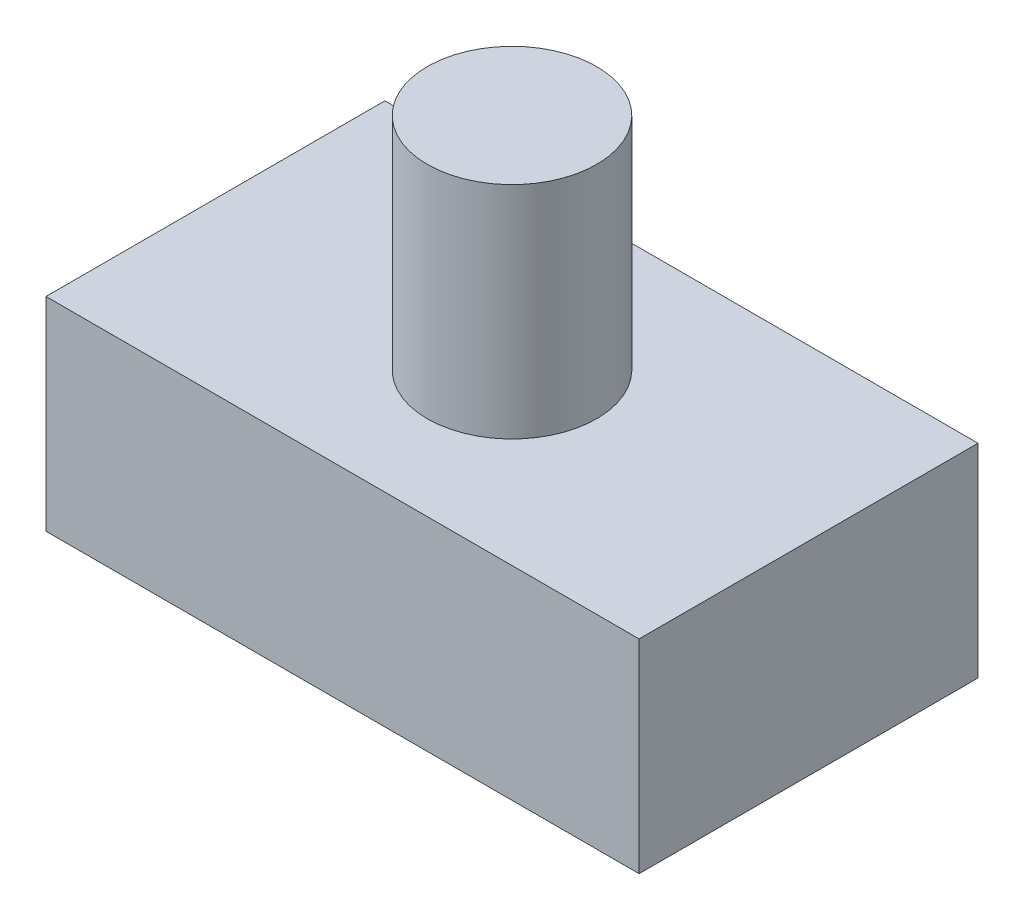
ISO-10303-21;
HEADER;
FILE_DESCRIPTION(('STEP AP214'),'2;1');
FILE_NAME('part.step','',(''),(''),'','','');
FILE_SCHEMA(('AUTOMOTIVE_DESIGN { 1 0 10303 214 1 1 1 1 }'));
ENDSEC;
DATA;
#1=APPLICATION_CONTEXT('core data for automotive mechanical design processes');
#2=APPLICATION_PROTOCOL_DEFINITION('international standard','automotive_design',2000,#1);
#3=PRODUCT_CONTEXT('',#1,'mechanical');
#4=PRODUCT('Part','Part','',(#3));
#5=PRODUCT_RELATED_PRODUCT_CATEGORY('part','',(#4));
#6=PRODUCT_DEFINITION_FORMATION('','',#4);
#7=PRODUCT_DEFINITION_CONTEXT('part definition',#1,'design');
#8=PRODUCT_DEFINITION('design','',#6,#7);
#9=PRODUCT_DEFINITION_SHAPE('','',#8);
#10=(LENGTH_UNIT() NAMED_UNIT(*) SI_UNIT(.MILLI.,.METRE.));
#11=(NAMED_UNIT(*) PLANE_ANGLE_UNIT() SI_UNIT($,.RADIAN.));
#12=(NAMED_UNIT(*) SI_UNIT($,.STERADIAN.) SOLID_ANGLE_UNIT());
#13=UNCERTAINTY_MEASURE_WITH_UNIT(LENGTH_MEASURE(1.E-05),#10,'distance_accuracy_value','');
#14=(GEOMETRIC_REPRESENTATION_CONTEXT(3) GLOBAL_UNCERTAINTY_ASSIGNED_CONTEXT((#13)) GLOBAL_UNIT_ASSIGNED_CONTEXT((#10,
#11,#12)) REPRESENTATION_CONTEXT('',''));
#15=CARTESIAN_POINT('',(0.,0.,0.));
#16=DIRECTION('',(0.,0.,1.));
#17=DIRECTION('',(1.,0.,0.));
#18=AXIS2_PLACEMENT_3D('',#15,#16,#17);
#19=CARTESIAN_POINT('',(0.,12.,0.));
#20=DIRECTION('',(0.,1.,0.));
#21=DIRECTION('',(0.,0.,1.));
#22=AXIS2_PLACEMENT_3D('',#19,#20,#21);
#23=PLANE('',#22);
#24=DIRECTION('',(0.,0.,-1.));
#25=VECTOR('',#24,1.);
#26=CARTESIAN_POINT('',(-17.5,12.,0.));
#27=LINE('',#26,#25);
#28=CARTESIAN_POINT('',(-17.5,12.,10.));
#29=VERTEX_POINT('',#28);
#30=CARTESIAN_POINT('',(-17.5,12.,-10.));
#31=VERTEX_POINT('',#30);
#32=EDGE_CURVE('E92',#29,#31,#27,.T.);
#33=ORIENTED_EDGE('',*,*,#32,.F.);
#34=DIRECTION('',(-1.,0.,0.));
#35=VECTOR('',#34,1.);
#36=CARTESIAN_POINT('',(0.,12.,10.));
#37=LINE('',#36,#35);
#38=CARTESIAN_POINT('',(17.5,12.,9.99999999999999));
#39=VERTEX_POINT('',#38);
#40=EDGE_CURVE('E84',#39,#29,#37,.T.);
#41=ORIENTED_EDGE('',*,*,#40,.F.);
#42=DIRECTION('',(0.,0.,-1.));
#43=VECTOR('',#42,1.);
#44=CARTESIAN_POINT('',(17.5,12.,0.));
#45=LINE('',#44,#43);
#46=CARTESIAN_POINT('',(17.5,12.,-10.));
#47=VERTEX_POINT('',#46);
#48=EDGE_CURVE('E88',#39,#47,#45,.T.);
#49=ORIENTED_EDGE('',*,*,#48,.T.);
#50=DIRECTION('',(-1.,0.,0.));
#51=VECTOR('',#50,1.);
#52=CARTESIAN_POINT('',(0.,12.,-10.));
#53=LINE('',#52,#51);
#54=EDGE_CURVE('E51',#47,#31,#53,.T.);
#55=ORIENTED_EDGE('',*,*,#54,.T.);
#56=EDGE_LOOP('',(#33,#41,#49,#55));
#57=FACE_BOUND('',#56,.T.);
#58=CARTESIAN_POINT('',(0.,12.,0.));
#59=DIRECTION('',(0.,1.,0.));
#60=DIRECTION('',(0.,0.,1.));
#61=AXIS2_PLACEMENT_3D('',#58,#59,#60);
#62=CIRCLE('',#61,5.);
#63=CARTESIAN_POINT('',(0.,12.,5.));
#64=VERTEX_POINT('',#63);
#65=EDGE_CURVE('E102',#64,#64,#62,.F.);
#66=ORIENTED_EDGE('',*,*,#65,.T.);
#67=EDGE_LOOP('',(#66));
#68=FACE_BOUND('',#67,.T.);
#69=ADVANCED_FACE('F34',(#57,#68),#23,.T.);
#70=CARTESIAN_POINT('',(-17.5,12.,0.));
#71=DIRECTION('',(-1.,0.,0.));
#72=DIRECTION('',(0.,0.,1.));
#73=AXIS2_PLACEMENT_3D('',#70,#71,#72);
#74=PLANE('',#73);
#75=DIRECTION('',(0.,0.,-1.));
#76=VECTOR('',#75,1.);
#77=CARTESIAN_POINT('',(-17.5,0.,0.));
#78=LINE('',#77,#76);
#79=CARTESIAN_POINT('',(-17.5,0.,10.));
#80=VERTEX_POINT('',#79);
#81=CARTESIAN_POINT('',(-17.5,0.,-10.));
#82=VERTEX_POINT('',#81);
#83=EDGE_CURVE('E99',#80,#82,#78,.T.);
#84=ORIENTED_EDGE('',*,*,#83,.F.);
#85=DIRECTION('',(0.,-1.,0.));
#86=VECTOR('',#85,1.);
#87=CARTESIAN_POINT('',(-17.5,12.,10.));
#88=LINE('',#87,#86);
#89=EDGE_CURVE('E11',#29,#80,#88,.T.);
#90=ORIENTED_EDGE('',*,*,#89,.F.);
#91=ORIENTED_EDGE('',*,*,#32,.T.);
#92=DIRECTION('',(0.,-1.,0.));
#93=VECTOR('',#92,1.);
#94=CARTESIAN_POINT('',(-17.5,12.,-10.));
#95=LINE('',#94,#93);
#96=EDGE_CURVE('E73',#31,#82,#95,.T.);
#97=ORIENTED_EDGE('',*,*,#96,.T.);
#98=EDGE_LOOP('',(#84,#90,#91,#97));
#99=FACE_BOUND('',#98,.T.);
#100=ADVANCED_FACE('F36',(#99),#74,.T.);
#101=CARTESIAN_POINT('',(0.,12.,10.));
#102=DIRECTION('',(0.,0.,1.));
#103=DIRECTION('',(1.,0.,0.));
#104=AXIS2_PLACEMENT_3D('',#101,#102,#103);
#105=PLANE('',#104);
#106=DIRECTION('',(-1.,0.,0.));
#107=VECTOR('',#106,1.);
#108=CARTESIAN_POINT('',(0.,0.,10.));
#109=LINE('',#108,#107);
#110=CARTESIAN_POINT('',(17.5,0.,9.99999999999999));
#111=VERTEX_POINT('',#110);
#112=EDGE_CURVE('E86',#111,#80,#109,.T.);
#113=ORIENTED_EDGE('',*,*,#112,.F.);
#114=DIRECTION('',(0.,-1.,0.));
#115=VECTOR('',#114,1.);
#116=CARTESIAN_POINT('',(17.5,12.,9.99999999999999));
#117=LINE('',#116,#115);
#118=EDGE_CURVE('E43',#39,#111,#117,.T.);
#119=ORIENTED_EDGE('',*,*,#118,.F.);
#120=ORIENTED_EDGE('',*,*,#40,.T.);
#121=ORIENTED_EDGE('',*,*,#89,.T.);
#122=EDGE_LOOP('',(#113,#119,#120,#121));
#123=FACE_BOUND('',#122,.T.);
#124=ADVANCED_FACE('F82',(#123),#105,.T.);
#125=CARTESIAN_POINT('',(17.5,12.,0.));
#126=DIRECTION('',(-1.,0.,0.));
#127=DIRECTION('',(0.,0.,1.));
#128=AXIS2_PLACEMENT_3D('',#125,#126,#127);
#129=PLANE('',#128);
#130=DIRECTION('',(0.,0.,-1.));
#131=VECTOR('',#130,1.);
#132=CARTESIAN_POINT('',(17.5,0.,0.));
#133=LINE('',#132,#131);
#134=CARTESIAN_POINT('',(17.5,0.,-10.));
#135=VERTEX_POINT('',#134);
#136=EDGE_CURVE('E66',#111,#135,#133,.T.);
#137=ORIENTED_EDGE('',*,*,#136,.T.);
#138=DIRECTION('',(0.,-1.,0.));
#139=VECTOR('',#138,1.);
#140=CARTESIAN_POINT('',(17.5,12.,-10.));
#141=LINE('',#140,#139);
#142=EDGE_CURVE('E87',#47,#135,#141,.T.);
#143=ORIENTED_EDGE('',*,*,#142,.F.);
#144=ORIENTED_EDGE('',*,*,#48,.F.);
#145=ORIENTED_EDGE('',*,*,#118,.T.);
#146=EDGE_LOOP('',(#137,#143,#144,#145));
#147=FACE_BOUND('',#146,.T.);
#148=ADVANCED_FACE('F89',(#147),#129,.F.);
#149=CARTESIAN_POINT('',(0.,12.,-10.));
#150=DIRECTION('',(0.,0.,1.));
#151=DIRECTION('',(1.,0.,0.));
#152=AXIS2_PLACEMENT_3D('',#149,#150,#151);
#153=PLANE('',#152);
#154=DIRECTION('',(-1.,0.,0.));
#155=VECTOR('',#154,1.);
#156=CARTESIAN_POINT('',(0.,0.,-10.));
#157=LINE('',#156,#155);
#158=EDGE_CURVE('E94',#135,#82,#157,.T.);
#159=ORIENTED_EDGE('',*,*,#158,.T.);
#160=ORIENTED_EDGE('',*,*,#96,.F.);
#161=ORIENTED_EDGE('',*,*,#54,.F.);
#162=ORIENTED_EDGE('',*,*,#142,.T.);
#163=EDGE_LOOP('',(#159,#160,#161,#162));
#164=FACE_BOUND('',#163,.T.);
#165=ADVANCED_FACE('F109',(#164),#153,.F.);
#166=CARTESIAN_POINT('',(0.,0.,0.));
#167=DIRECTION('',(0.,1.,0.));
#168=DIRECTION('',(0.,0.,1.));
#169=AXIS2_PLACEMENT_3D('',#166,#167,#168);
#170=PLANE('',#169);
#171=ORIENTED_EDGE('',*,*,#83,.T.);
#172=ORIENTED_EDGE('',*,*,#158,.F.);
#173=ORIENTED_EDGE('',*,*,#136,.F.);
#174=ORIENTED_EDGE('',*,*,#112,.T.);
#175=EDGE_LOOP('',(#171,#172,#173,#174));
#176=FACE_BOUND('',#175,.T.);
#177=ADVANCED_FACE('F111',(#176),#170,.F.);
#178=CARTESIAN_POINT('',(0.,25.,0.));
#179=DIRECTION('',(0.,-1.,0.));
#180=DIRECTION('',(0.,0.,-1.));
#181=AXIS2_PLACEMENT_3D('',#178,#179,#180);
#182=CYLINDRICAL_SURFACE('',#181,5.);
#183=ORIENTED_EDGE('',*,*,#65,.F.);
#184=EDGE_LOOP('',(#183));
#185=FACE_BOUND('',#184,.T.);
#186=CARTESIAN_POINT('',(0.,25.,0.));
#187=DIRECTION('',(0.,1.,0.));
#188=DIRECTION('',(0.,0.,1.));
#189=AXIS2_PLACEMENT_3D('',#186,#187,#188);
#190=CIRCLE('',#189,5.);
#191=CARTESIAN_POINT('',(0.,25.,5.));
#192=VERTEX_POINT('',#191);
#193=EDGE_CURVE('E180',#192,#192,#190,.T.);
#194=ORIENTED_EDGE('',*,*,#193,.F.);
#195=EDGE_LOOP('',(#194));
#196=FACE_BOUND('',#195,.T.);
#197=ADVANCED_FACE('F122',(#185,#196),#182,.T.);
#198=CARTESIAN_POINT('',(0.,25.,0.));
#199=DIRECTION('',(0.,1.,0.));
#200=DIRECTION('',(0.,0.,1.));
#201=AXIS2_PLACEMENT_3D('',#198,#199,#200);
#202=PLANE('',#201);
#203=ORIENTED_EDGE('',*,*,#193,.T.);
#204=EDGE_LOOP('',(#203));
#205=FACE_BOUND('',#204,.T.);
#206=ADVANCED_FACE('F147',(#205),#202,.T.);
#207=CLOSED_SHELL('',(#69,#100,#124,#148,#165,#177,#197,#206));
#208=MANIFOLD_SOLID_BREP('B2',#207);
#209=ADVANCED_BREP_SHAPE_REPRESENTATION('',(#18,#208),#14);
#210=SHAPE_DEFINITION_REPRESENTATION(#9,#209);
ENDSEC;
END-ISO-10303-21;
